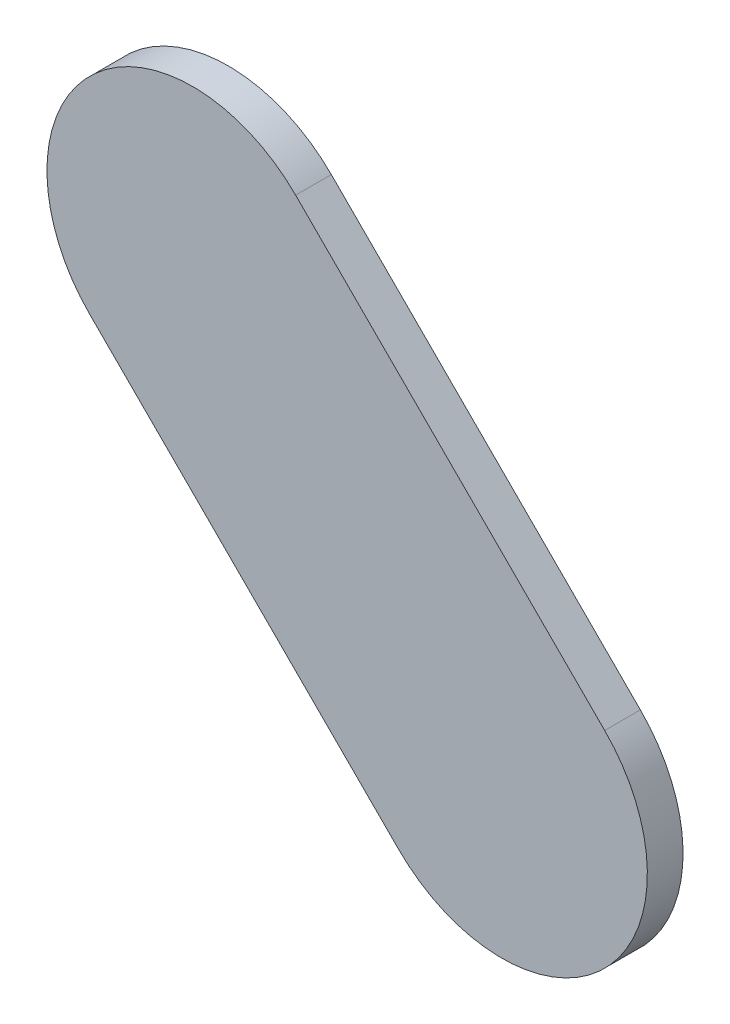
ISO-10303-21;
HEADER;
FILE_DESCRIPTION(('STEP AP214'),'2;1');
FILE_NAME('part.step','',(''),(''),'','','');
FILE_SCHEMA(('AUTOMOTIVE_DESIGN { 1 0 10303 214 1 1 1 1 }'));
ENDSEC;
DATA;
#1=APPLICATION_CONTEXT('core data for automotive mechanical design processes');
#2=APPLICATION_PROTOCOL_DEFINITION('international standard','automotive_design',2000,#1);
#3=PRODUCT_CONTEXT('',#1,'mechanical');
#4=PRODUCT('Part','Part','',(#3));
#5=PRODUCT_RELATED_PRODUCT_CATEGORY('part','',(#4));
#6=PRODUCT_DEFINITION_FORMATION('','',#4);
#7=PRODUCT_DEFINITION_CONTEXT('part definition',#1,'design');
#8=PRODUCT_DEFINITION('design','',#6,#7);
#9=PRODUCT_DEFINITION_SHAPE('','',#8);
#10=(LENGTH_UNIT() NAMED_UNIT(*) SI_UNIT(.MILLI.,.METRE.));
#11=(NAMED_UNIT(*) PLANE_ANGLE_UNIT() SI_UNIT($,.RADIAN.));
#12=(NAMED_UNIT(*) SI_UNIT($,.STERADIAN.) SOLID_ANGLE_UNIT());
#13=UNCERTAINTY_MEASURE_WITH_UNIT(LENGTH_MEASURE(1.E-05),#10,'distance_accuracy_value','');
#14=(GEOMETRIC_REPRESENTATION_CONTEXT(3) GLOBAL_UNCERTAINTY_ASSIGNED_CONTEXT((#13)) GLOBAL_UNIT_ASSIGNED_CONTEXT((#10,
#11,#12)) REPRESENTATION_CONTEXT('',''));
#15=CARTESIAN_POINT('',(0.,0.,0.));
#16=DIRECTION('',(0.,0.,1.));
#17=DIRECTION('',(1.,0.,0.));
#18=AXIS2_PLACEMENT_3D('',#15,#16,#17);
#19=CARTESIAN_POINT('',(2.665268332428,5.910824039131,0.79916));
#20=DIRECTION('',(0.,0.,1.));
#21=DIRECTION('',(1.,0.,0.));
#22=AXIS2_PLACEMENT_3D('',#19,#20,#21);
#23=PLANE('',#22);
#24=CARTESIAN_POINT('',(2.516882333,6.058690434268,0.79916));
#25=DIRECTION('',(0.,0.,1.));
#26=DIRECTION('',(1.,0.,0.));
#27=AXIS2_PLACEMENT_3D('',#24,#25,#26);
#28=CIRCLE('',#27,0.140000472348);
#29=CARTESIAN_POINT('',(2.41788722183356,5.9596954441665,0.79916));
#30=VERTEX_POINT('',#29);
#31=CARTESIAN_POINT('',(2.61587769726737,6.15768563673356,0.79916));
#32=VERTEX_POINT('',#31);
#33=EDGE_CURVE('E20',#30,#32,#28,.F.);
#34=ORIENTED_EDGE('',*,*,#33,.F.);
#35=DIRECTION('',(-0.707107575236102,0.707105987136102,0.));
#36=VECTOR('',#35,1.);
#37=CARTESIAN_POINT('',(2.714872333001,5.662711000001,0.79916));
#38=LINE('',#37,#36);
#39=CARTESIAN_POINT('',(2.71487241390159,5.66271091910059,0.79916));
#40=VERTEX_POINT('',#39);
#41=EDGE_CURVE('E65',#30,#40,#38,.F.);
#42=ORIENTED_EDGE('',*,*,#41,.T.);
#43=CARTESIAN_POINT('',(2.813867333,5.761705333,0.79916));
#44=DIRECTION('',(0.,0.,1.));
#45=DIRECTION('',(1.,0.,0.));
#46=AXIS2_PLACEMENT_3D('',#43,#44,#45);
#47=CIRCLE('',#46,0.140000072315);
#48=CARTESIAN_POINT('',(2.91286222233318,5.86070044466619,0.79916));
#49=VERTEX_POINT('',#48);
#50=EDGE_CURVE('E57',#49,#40,#47,.F.);
#51=ORIENTED_EDGE('',*,*,#50,.F.);
#52=DIRECTION('',(0.707105987136602,-0.707107575235602,0.));
#53=VECTOR('',#52,1.);
#54=CARTESIAN_POINT('',(2.615877667001,6.157685667,0.79916));
#55=LINE('',#54,#53);
#56=EDGE_CURVE('E64',#49,#32,#55,.F.);
#57=ORIENTED_EDGE('',*,*,#56,.T.);
#58=EDGE_LOOP('',(#34,#42,#51,#57));
#59=FACE_BOUND('',#58,.T.);
#60=ADVANCED_FACE('F17',(#59),#23,.T.);
#61=CARTESIAN_POINT('',(2.714872333001,5.662711000001,0.76487));
#62=DIRECTION('',(0.707105987136102,0.707107575236102,0.));
#63=DIRECTION('',(-0.707107575236102,0.707105987136102,0.));
#64=AXIS2_PLACEMENT_3D('',#61,#62,#63);
#65=PLANE('',#64);
#66=DIRECTION('',(0.,0.,1.));
#67=VECTOR('',#66,1.);
#68=CARTESIAN_POINT('',(2.41788733300002,5.95969533300002,0.76487));
#69=LINE('',#68,#67);
#70=CARTESIAN_POINT('',(2.41788722183344,5.95969544416632,0.76487));
#71=VERTEX_POINT('',#70);
#72=EDGE_CURVE('E68',#71,#30,#69,.T.);
#73=ORIENTED_EDGE('',*,*,#72,.F.);
#74=DIRECTION('',(-0.707107575236587,0.707105987135616,0.));
#75=VECTOR('',#74,1.);
#76=CARTESIAN_POINT('',(2.714872333001,5.662711000001,0.76487));
#77=LINE('',#76,#75);
#78=CARTESIAN_POINT('',(2.71487241390162,5.66271091910056,0.76487));
#79=VERTEX_POINT('',#78);
#80=EDGE_CURVE('E72',#79,#71,#77,.T.);
#81=ORIENTED_EDGE('',*,*,#80,.F.);
#82=DIRECTION('',(0.,0.,1.));
#83=VECTOR('',#82,1.);
#84=CARTESIAN_POINT('',(2.714872333001,5.662711000001,0.76487));
#85=LINE('',#84,#83);
#86=EDGE_CURVE('E60',#40,#79,#85,.F.);
#87=ORIENTED_EDGE('',*,*,#86,.F.);
#88=ORIENTED_EDGE('',*,*,#41,.F.);
#89=EDGE_LOOP('',(#73,#81,#87,#88));
#90=FACE_BOUND('',#89,.T.);
#91=ADVANCED_FACE('F70',(#90),#65,.F.);
#92=CARTESIAN_POINT('',(2.516882333,6.058690434268,0.76487));
#93=DIRECTION('',(0.,0.,1.));
#94=DIRECTION('',(1.,0.,0.));
#95=AXIS2_PLACEMENT_3D('',#92,#93,#94);
#96=CYLINDRICAL_SURFACE('',#95,0.140000472348);
#97=DIRECTION('',(0.,0.,1.));
#98=VECTOR('',#97,1.);
#99=CARTESIAN_POINT('',(2.615877667001,6.157685667,0.76487));
#100=LINE('',#99,#98);
#101=CARTESIAN_POINT('',(2.61587769726735,6.15768563673358,0.76487));
#102=VERTEX_POINT('',#101);
#103=EDGE_CURVE('E77',#32,#102,#100,.F.);
#104=ORIENTED_EDGE('',*,*,#103,.T.);
#105=CARTESIAN_POINT('',(2.516882,6.058690667,0.76487));
#106=DIRECTION('',(0.,0.,1.));
#107=DIRECTION('',(1.,0.,0.));
#108=AXIS2_PLACEMENT_3D('',#105,#106,#107);
#109=CIRCLE('',#108,0.140000072315);
#110=EDGE_CURVE('E26',#71,#102,#109,.F.);
#111=ORIENTED_EDGE('',*,*,#110,.F.);
#112=ORIENTED_EDGE('',*,*,#72,.T.);
#113=ORIENTED_EDGE('',*,*,#33,.T.);
#114=EDGE_LOOP('',(#104,#111,#112,#113));
#115=FACE_BOUND('',#114,.T.);
#116=ADVANCED_FACE('F88',(#115),#96,.T.);
#117=CARTESIAN_POINT('',(2.615877667001,6.157685667,0.76487));
#118=DIRECTION('',(-0.707107575235602,-0.707105987136602,0.));
#119=DIRECTION('',(0.707105987136602,-0.707107575235602,0.));
#120=AXIS2_PLACEMENT_3D('',#117,#118,#119);
#121=PLANE('',#120);
#122=DIRECTION('',(0.,0.,1.));
#123=VECTOR('',#122,1.);
#124=CARTESIAN_POINT('',(2.91286199999998,5.86070066699998,0.76487));
#125=LINE('',#124,#123);
#126=CARTESIAN_POINT('',(2.91286222233323,5.86070044466627,0.76487));
#127=VERTEX_POINT('',#126);
#128=EDGE_CURVE('E62',#127,#49,#125,.T.);
#129=ORIENTED_EDGE('',*,*,#128,.F.);
#130=DIRECTION('',(0.707105987136806,-0.707107575235397,0.));
#131=VECTOR('',#130,1.);
#132=CARTESIAN_POINT('',(2.615877667001,6.157685667,0.76487));
#133=LINE('',#132,#131);
#134=EDGE_CURVE('E11',#102,#127,#133,.T.);
#135=ORIENTED_EDGE('',*,*,#134,.F.);
#136=ORIENTED_EDGE('',*,*,#103,.F.);
#137=ORIENTED_EDGE('',*,*,#56,.F.);
#138=EDGE_LOOP('',(#129,#135,#136,#137));
#139=FACE_BOUND('',#138,.T.);
#140=ADVANCED_FACE('F96',(#139),#121,.F.);
#141=CARTESIAN_POINT('',(2.813867333,5.761705333,0.76487));
#142=DIRECTION('',(0.,0.,1.));
#143=DIRECTION('',(1.,0.,0.));
#144=AXIS2_PLACEMENT_3D('',#141,#142,#143);
#145=CYLINDRICAL_SURFACE('',#144,0.140000072315);
#146=CARTESIAN_POINT('',(2.813867333001,5.761705898733,0.76487));
#147=DIRECTION('',(0.,0.,1.));
#148=DIRECTION('',(1.,0.,0.));
#149=AXIS2_PLACEMENT_3D('',#146,#147,#148);
#150=CIRCLE('',#149,0.14);
#151=EDGE_CURVE('E35',#127,#79,#150,.F.);
#152=ORIENTED_EDGE('',*,*,#151,.F.);
#153=ORIENTED_EDGE('',*,*,#128,.T.);
#154=ORIENTED_EDGE('',*,*,#50,.T.);
#155=ORIENTED_EDGE('',*,*,#86,.T.);
#156=EDGE_LOOP('',(#152,#153,#154,#155));
#157=FACE_BOUND('',#156,.T.);
#158=ADVANCED_FACE('F58',(#157),#145,.T.);
#159=CARTESIAN_POINT('',(2.665268332428,5.910824039131,0.76487));
#160=DIRECTION('',(0.,0.,-1.));
#161=DIRECTION('',(-1.,0.,0.));
#162=AXIS2_PLACEMENT_3D('',#159,#160,#161);
#163=PLANE('',#162);
#164=ORIENTED_EDGE('',*,*,#134,.T.);
#165=ORIENTED_EDGE('',*,*,#151,.T.);
#166=ORIENTED_EDGE('',*,*,#80,.T.);
#167=ORIENTED_EDGE('',*,*,#110,.T.);
#168=EDGE_LOOP('',(#164,#165,#166,#167));
#169=FACE_BOUND('',#168,.T.);
#170=ADVANCED_FACE('F89',(#169),#163,.T.);
#171=CLOSED_SHELL('',(#60,#91,#116,#140,#158,#170));
#172=MANIFOLD_SOLID_BREP('B1',#171);
#173=ADVANCED_BREP_SHAPE_REPRESENTATION('',(#18,#172),#14);
#174=SHAPE_DEFINITION_REPRESENTATION(#9,#173);
ENDSEC;
END-ISO-10303-21;
